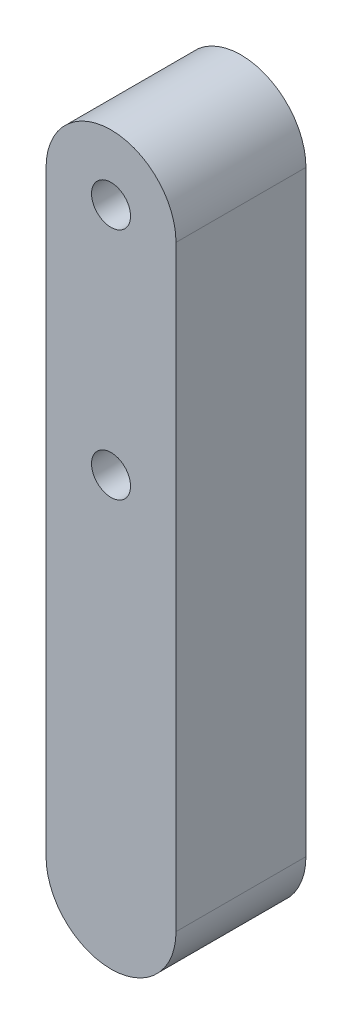
ISO-10303-21;
HEADER;
FILE_DESCRIPTION(('STEP AP214'),'2;1');
FILE_NAME('part.step','',(''),(''),'','','');
FILE_SCHEMA(('AUTOMOTIVE_DESIGN { 1 0 10303 214 1 1 1 1 }'));
ENDSEC;
DATA;
#1=APPLICATION_CONTEXT('core data for automotive mechanical design processes');
#2=APPLICATION_PROTOCOL_DEFINITION('international standard','automotive_design',2000,#1);
#3=PRODUCT_CONTEXT('',#1,'mechanical');
#4=PRODUCT('Part','Part','',(#3));
#5=PRODUCT_RELATED_PRODUCT_CATEGORY('part','',(#4));
#6=PRODUCT_DEFINITION_FORMATION('','',#4);
#7=PRODUCT_DEFINITION_CONTEXT('part definition',#1,'design');
#8=PRODUCT_DEFINITION('design','',#6,#7);
#9=PRODUCT_DEFINITION_SHAPE('','',#8);
#10=(LENGTH_UNIT() NAMED_UNIT(*) SI_UNIT(.MILLI.,.METRE.));
#11=(NAMED_UNIT(*) PLANE_ANGLE_UNIT() SI_UNIT($,.RADIAN.));
#12=(NAMED_UNIT(*) SI_UNIT($,.STERADIAN.) SOLID_ANGLE_UNIT());
#13=UNCERTAINTY_MEASURE_WITH_UNIT(LENGTH_MEASURE(1.E-05),#10,'distance_accuracy_value','');
#14=(GEOMETRIC_REPRESENTATION_CONTEXT(3) GLOBAL_UNCERTAINTY_ASSIGNED_CONTEXT((#13)) GLOBAL_UNIT_ASSIGNED_CONTEXT((#10,
#11,#12)) REPRESENTATION_CONTEXT('',''));
#15=CARTESIAN_POINT('',(0.,0.,0.));
#16=DIRECTION('',(0.,0.,1.));
#17=DIRECTION('',(1.,0.,0.));
#18=AXIS2_PLACEMENT_3D('',#15,#16,#17);
#19=CARTESIAN_POINT('',(0.,18.,-20.));
#20=DIRECTION('',(0.,0.,-1.));
#21=DIRECTION('',(-1.,0.,0.));
#22=AXIS2_PLACEMENT_3D('',#19,#20,#21);
#23=PLANE('',#22);
#24=CARTESIAN_POINT('',(0.,18.,-20.));
#25=DIRECTION('',(0.,0.,-1.));
#26=DIRECTION('',(-1.,0.,0.));
#27=AXIS2_PLACEMENT_3D('',#24,#25,#26);
#28=CIRCLE('',#27,3.);
#29=CARTESIAN_POINT('',(-2.99999999999999,18.,-20.));
#30=VERTEX_POINT('',#29);
#31=EDGE_CURVE('E101',#30,#30,#28,.T.);
#32=ORIENTED_EDGE('',*,*,#31,.F.);
#33=EDGE_LOOP('',(#32));
#34=FACE_BOUND('',#33,.T.);
#35=CARTESIAN_POINT('',(0.,18.,-20.));
#36=DIRECTION('',(0.,0.,-1.));
#37=DIRECTION('',(-1.,0.,0.));
#38=AXIS2_PLACEMENT_3D('',#35,#36,#37);
#39=CIRCLE('',#38,10.);
#40=CARTESIAN_POINT('',(-10.,18.,-20.));
#41=VERTEX_POINT('',#40);
#42=CARTESIAN_POINT('',(10.,18.,-20.));
#43=VERTEX_POINT('',#42);
#44=EDGE_CURVE('E86',#41,#43,#39,.T.);
#45=ORIENTED_EDGE('',*,*,#44,.T.);
#46=DIRECTION('',(0.,-1.,0.));
#47=VECTOR('',#46,1.);
#48=CARTESIAN_POINT('',(10.,18.,-20.));
#49=LINE('',#48,#47);
#50=CARTESIAN_POINT('',(10.,-73.8773209467205,-20.));
#51=VERTEX_POINT('',#50);
#52=EDGE_CURVE('E81',#43,#51,#49,.T.);
#53=ORIENTED_EDGE('',*,*,#52,.T.);
#54=CARTESIAN_POINT('',(0.,-73.8773209467205,-20.));
#55=DIRECTION('',(0.,0.,-1.));
#56=DIRECTION('',(-1.,0.,0.));
#57=AXIS2_PLACEMENT_3D('',#54,#55,#56);
#58=CIRCLE('',#57,10.);
#59=CARTESIAN_POINT('',(-10.,-73.8773209467205,-20.));
#60=VERTEX_POINT('',#59);
#61=EDGE_CURVE('E84',#51,#60,#58,.T.);
#62=ORIENTED_EDGE('',*,*,#61,.T.);
#63=DIRECTION('',(0.,1.,0.));
#64=VECTOR('',#63,1.);
#65=CARTESIAN_POINT('',(-10.,18.,-20.));
#66=LINE('',#65,#64);
#67=EDGE_CURVE('E51',#60,#41,#66,.T.);
#68=ORIENTED_EDGE('',*,*,#67,.T.);
#69=EDGE_LOOP('',(#45,#53,#62,#68));
#70=FACE_BOUND('',#69,.T.);
#71=CARTESIAN_POINT('',(0.,-18.,-20.));
#72=DIRECTION('',(0.,0.,-1.));
#73=DIRECTION('',(-1.,0.,0.));
#74=AXIS2_PLACEMENT_3D('',#71,#72,#73);
#75=CIRCLE('',#74,3.);
#76=CARTESIAN_POINT('',(-3.,-18.,-20.));
#77=VERTEX_POINT('',#76);
#78=EDGE_CURVE('E116',#77,#77,#75,.T.);
#79=ORIENTED_EDGE('',*,*,#78,.F.);
#80=EDGE_LOOP('',(#79));
#81=FACE_BOUND('',#80,.T.);
#82=ADVANCED_FACE('F34',(#34,#70,#81),#23,.T.);
#83=CARTESIAN_POINT('',(0.,18.,0.));
#84=DIRECTION('',(0.,0.,-1.));
#85=DIRECTION('',(-1.,0.,0.));
#86=AXIS2_PLACEMENT_3D('',#83,#84,#85);
#87=PLANE('',#86);
#88=CARTESIAN_POINT('',(0.,18.,0.));
#89=DIRECTION('',(0.,0.,-1.));
#90=DIRECTION('',(-1.,0.,0.));
#91=AXIS2_PLACEMENT_3D('',#88,#89,#90);
#92=CIRCLE('',#91,10.);
#93=CARTESIAN_POINT('',(-10.,18.,0.));
#94=VERTEX_POINT('',#93);
#95=CARTESIAN_POINT('',(10.,18.,0.));
#96=VERTEX_POINT('',#95);
#97=EDGE_CURVE('E98',#94,#96,#92,.T.);
#98=ORIENTED_EDGE('',*,*,#97,.F.);
#99=DIRECTION('',(0.,1.,0.));
#100=VECTOR('',#99,1.);
#101=CARTESIAN_POINT('',(-10.,18.,0.));
#102=LINE('',#101,#100);
#103=CARTESIAN_POINT('',(-10.,-73.8773209467205,0.));
#104=VERTEX_POINT('',#103);
#105=EDGE_CURVE('E74',#104,#94,#102,.T.);
#106=ORIENTED_EDGE('',*,*,#105,.F.);
#107=CARTESIAN_POINT('',(0.,-73.8773209467205,0.));
#108=DIRECTION('',(0.,0.,-1.));
#109=DIRECTION('',(-1.,0.,0.));
#110=AXIS2_PLACEMENT_3D('',#107,#108,#109);
#111=CIRCLE('',#110,10.);
#112=CARTESIAN_POINT('',(10.,-73.8773209467205,0.));
#113=VERTEX_POINT('',#112);
#114=EDGE_CURVE('E68',#113,#104,#111,.T.);
#115=ORIENTED_EDGE('',*,*,#114,.F.);
#116=DIRECTION('',(0.,-1.,0.));
#117=VECTOR('',#116,1.);
#118=CARTESIAN_POINT('',(10.,18.,0.));
#119=LINE('',#118,#117);
#120=EDGE_CURVE('E90',#96,#113,#119,.T.);
#121=ORIENTED_EDGE('',*,*,#120,.F.);
#122=EDGE_LOOP('',(#98,#106,#115,#121));
#123=FACE_BOUND('',#122,.T.);
#124=CARTESIAN_POINT('',(0.,18.,0.));
#125=DIRECTION('',(0.,0.,-1.));
#126=DIRECTION('',(-1.,0.,0.));
#127=AXIS2_PLACEMENT_3D('',#124,#125,#126);
#128=CIRCLE('',#127,3.);
#129=CARTESIAN_POINT('',(-2.99999999999999,18.,0.));
#130=VERTEX_POINT('',#129);
#131=EDGE_CURVE('E113',#130,#130,#128,.T.);
#132=ORIENTED_EDGE('',*,*,#131,.T.);
#133=EDGE_LOOP('',(#132));
#134=FACE_BOUND('',#133,.T.);
#135=CARTESIAN_POINT('',(0.,-18.,0.));
#136=DIRECTION('',(0.,0.,-1.));
#137=DIRECTION('',(-1.,0.,0.));
#138=AXIS2_PLACEMENT_3D('',#135,#136,#137);
#139=CIRCLE('',#138,3.);
#140=CARTESIAN_POINT('',(-3.,-18.,0.));
#141=VERTEX_POINT('',#140);
#142=EDGE_CURVE('E119',#141,#141,#139,.T.);
#143=ORIENTED_EDGE('',*,*,#142,.T.);
#144=EDGE_LOOP('',(#143));
#145=FACE_BOUND('',#144,.T.);
#146=ADVANCED_FACE('F109',(#123,#134,#145),#87,.F.);
#147=CARTESIAN_POINT('',(0.,18.,-20.));
#148=DIRECTION('',(0.,0.,1.));
#149=DIRECTION('',(1.,0.,0.));
#150=AXIS2_PLACEMENT_3D('',#147,#148,#149);
#151=CYLINDRICAL_SURFACE('',#150,10.);
#152=ORIENTED_EDGE('',*,*,#97,.T.);
#153=DIRECTION('',(0.,0.,1.));
#154=VECTOR('',#153,1.);
#155=CARTESIAN_POINT('',(10.,18.,-20.));
#156=LINE('',#155,#154);
#157=EDGE_CURVE('E11',#43,#96,#156,.T.);
#158=ORIENTED_EDGE('',*,*,#157,.F.);
#159=ORIENTED_EDGE('',*,*,#44,.F.);
#160=DIRECTION('',(0.,0.,1.));
#161=VECTOR('',#160,1.);
#162=CARTESIAN_POINT('',(-10.,18.,-20.));
#163=LINE('',#162,#161);
#164=EDGE_CURVE('E94',#41,#94,#163,.T.);
#165=ORIENTED_EDGE('',*,*,#164,.T.);
#166=EDGE_LOOP('',(#152,#158,#159,#165));
#167=FACE_BOUND('',#166,.T.);
#168=ADVANCED_FACE('F36',(#167),#151,.T.);
#169=CARTESIAN_POINT('',(10.,18.,-20.));
#170=DIRECTION('',(-1.,0.,0.));
#171=DIRECTION('',(0.,-1.,0.));
#172=AXIS2_PLACEMENT_3D('',#169,#170,#171);
#173=PLANE('',#172);
#174=ORIENTED_EDGE('',*,*,#120,.T.);
#175=DIRECTION('',(0.,0.,1.));
#176=VECTOR('',#175,1.);
#177=CARTESIAN_POINT('',(10.,-73.8773209467205,-20.));
#178=LINE('',#177,#176);
#179=EDGE_CURVE('E43',#51,#113,#178,.T.);
#180=ORIENTED_EDGE('',*,*,#179,.F.);
#181=ORIENTED_EDGE('',*,*,#52,.F.);
#182=ORIENTED_EDGE('',*,*,#157,.T.);
#183=EDGE_LOOP('',(#174,#180,#181,#182));
#184=FACE_BOUND('',#183,.T.);
#185=ADVANCED_FACE('F89',(#184),#173,.F.);
#186=CARTESIAN_POINT('',(0.,-73.8773209467205,-20.));
#187=DIRECTION('',(0.,0.,1.));
#188=DIRECTION('',(1.,0.,0.));
#189=AXIS2_PLACEMENT_3D('',#186,#187,#188);
#190=CYLINDRICAL_SURFACE('',#189,10.);
#191=ORIENTED_EDGE('',*,*,#114,.T.);
#192=DIRECTION('',(0.,0.,1.));
#193=VECTOR('',#192,1.);
#194=CARTESIAN_POINT('',(-10.,-73.8773209467205,-20.));
#195=LINE('',#194,#193);
#196=EDGE_CURVE('E91',#60,#104,#195,.T.);
#197=ORIENTED_EDGE('',*,*,#196,.F.);
#198=ORIENTED_EDGE('',*,*,#61,.F.);
#199=ORIENTED_EDGE('',*,*,#179,.T.);
#200=EDGE_LOOP('',(#191,#197,#198,#199));
#201=FACE_BOUND('',#200,.T.);
#202=ADVANCED_FACE('F92',(#201),#190,.T.);
#203=CARTESIAN_POINT('',(-10.,18.,-20.));
#204=DIRECTION('',(1.,0.,0.));
#205=DIRECTION('',(0.,1.,0.));
#206=AXIS2_PLACEMENT_3D('',#203,#204,#205);
#207=PLANE('',#206);
#208=ORIENTED_EDGE('',*,*,#105,.T.);
#209=ORIENTED_EDGE('',*,*,#164,.F.);
#210=ORIENTED_EDGE('',*,*,#67,.F.);
#211=ORIENTED_EDGE('',*,*,#196,.T.);
#212=EDGE_LOOP('',(#208,#209,#210,#211));
#213=FACE_BOUND('',#212,.T.);
#214=ADVANCED_FACE('F106',(#213),#207,.F.);
#215=CARTESIAN_POINT('',(0.,18.,-20.));
#216=DIRECTION('',(0.,0.,1.));
#217=DIRECTION('',(1.,0.,0.));
#218=AXIS2_PLACEMENT_3D('',#215,#216,#217);
#219=CYLINDRICAL_SURFACE('',#218,3.);
#220=ORIENTED_EDGE('',*,*,#31,.T.);
#221=EDGE_LOOP('',(#220));
#222=FACE_BOUND('',#221,.T.);
#223=ORIENTED_EDGE('',*,*,#131,.F.);
#224=EDGE_LOOP('',(#223));
#225=FACE_BOUND('',#224,.T.);
#226=ADVANCED_FACE('F136',(#222,#225),#219,.F.);
#227=CARTESIAN_POINT('',(0.,-18.,-20.));
#228=DIRECTION('',(0.,0.,1.));
#229=DIRECTION('',(1.,0.,0.));
#230=AXIS2_PLACEMENT_3D('',#227,#228,#229);
#231=CYLINDRICAL_SURFACE('',#230,3.);
#232=ORIENTED_EDGE('',*,*,#78,.T.);
#233=EDGE_LOOP('',(#232));
#234=FACE_BOUND('',#233,.T.);
#235=ORIENTED_EDGE('',*,*,#142,.F.);
#236=EDGE_LOOP('',(#235));
#237=FACE_BOUND('',#236,.T.);
#238=ADVANCED_FACE('F125',(#234,#237),#231,.F.);
#239=CLOSED_SHELL('',(#82,#146,#168,#185,#202,#214,#226,#238));
#240=MANIFOLD_SOLID_BREP('B2',#239);
#241=ADVANCED_BREP_SHAPE_REPRESENTATION('',(#18,#240),#14);
#242=SHAPE_DEFINITION_REPRESENTATION(#9,#241);
ENDSEC;
END-ISO-10303-21;
